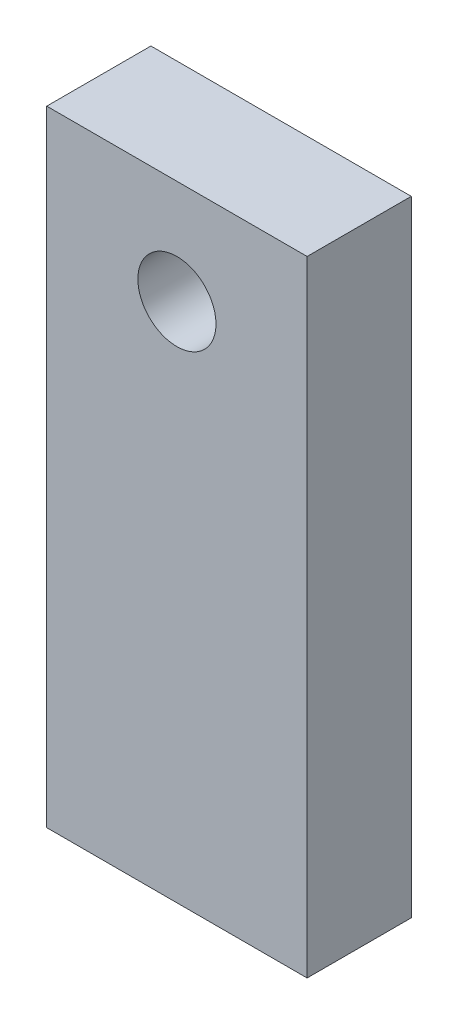
ISO-10303-21;
HEADER;
FILE_DESCRIPTION(('STEP AP214'),'2;1');
FILE_NAME('part.step','',(''),(''),'','','');
FILE_SCHEMA(('AUTOMOTIVE_DESIGN { 1 0 10303 214 1 1 1 1 }'));
ENDSEC;
DATA;
#1=APPLICATION_CONTEXT('core data for automotive mechanical design processes');
#2=APPLICATION_PROTOCOL_DEFINITION('international standard','automotive_design',2000,#1);
#3=PRODUCT_CONTEXT('',#1,'mechanical');
#4=PRODUCT('Part','Part','',(#3));
#5=PRODUCT_RELATED_PRODUCT_CATEGORY('part','',(#4));
#6=PRODUCT_DEFINITION_FORMATION('','',#4);
#7=PRODUCT_DEFINITION_CONTEXT('part definition',#1,'design');
#8=PRODUCT_DEFINITION('design','',#6,#7);
#9=PRODUCT_DEFINITION_SHAPE('','',#8);
#10=(LENGTH_UNIT() NAMED_UNIT(*) SI_UNIT(.MILLI.,.METRE.));
#11=(NAMED_UNIT(*) PLANE_ANGLE_UNIT() SI_UNIT($,.RADIAN.));
#12=(NAMED_UNIT(*) SI_UNIT($,.STERADIAN.) SOLID_ANGLE_UNIT());
#13=UNCERTAINTY_MEASURE_WITH_UNIT(LENGTH_MEASURE(1.E-05),#10,'distance_accuracy_value','');
#14=(GEOMETRIC_REPRESENTATION_CONTEXT(3) GLOBAL_UNCERTAINTY_ASSIGNED_CONTEXT((#13)) GLOBAL_UNIT_ASSIGNED_CONTEXT((#10,
#11,#12)) REPRESENTATION_CONTEXT('',''));
#15=CARTESIAN_POINT('',(0.,0.,0.));
#16=DIRECTION('',(0.,0.,1.));
#17=DIRECTION('',(1.,0.,0.));
#18=AXIS2_PLACEMENT_3D('',#15,#16,#17);
#19=CARTESIAN_POINT('',(0.,0.,4.));
#20=DIRECTION('',(0.,0.,1.));
#21=DIRECTION('',(1.,0.,0.));
#22=AXIS2_PLACEMENT_3D('',#19,#20,#21);
#23=PLANE('',#22);
#24=DIRECTION('',(1.,0.,0.));
#25=VECTOR('',#24,1.);
#26=CARTESIAN_POINT('',(-10.,570.,4.));
#27=LINE('',#26,#25);
#28=CARTESIAN_POINT('',(-10.,570.,4.));
#29=VERTEX_POINT('',#28);
#30=CARTESIAN_POINT('',(10.,570.,4.));
#31=VERTEX_POINT('',#30);
#32=EDGE_CURVE('E165',#29,#31,#27,.T.);
#33=ORIENTED_EDGE('',*,*,#32,.T.);
#34=DIRECTION('',(0.,1.,0.));
#35=VECTOR('',#34,1.);
#36=CARTESIAN_POINT('',(10.,570.,4.));
#37=LINE('',#36,#35);
#38=CARTESIAN_POINT('',(10.,618.,4.));
#39=VERTEX_POINT('',#38);
#40=EDGE_CURVE('E135',#31,#39,#37,.T.);
#41=ORIENTED_EDGE('',*,*,#40,.T.);
#42=DIRECTION('',(1.,0.,0.));
#43=VECTOR('',#42,1.);
#44=CARTESIAN_POINT('',(-10.,618.,4.));
#45=LINE('',#44,#43);
#46=CARTESIAN_POINT('',(-10.,618.,4.));
#47=VERTEX_POINT('',#46);
#48=EDGE_CURVE('E170',#47,#39,#45,.T.);
#49=ORIENTED_EDGE('',*,*,#48,.F.);
#50=DIRECTION('',(0.,1.,0.));
#51=VECTOR('',#50,1.);
#52=CARTESIAN_POINT('',(-10.,610.,4.));
#53=LINE('',#52,#51);
#54=EDGE_CURVE('E103',#29,#47,#53,.T.);
#55=ORIENTED_EDGE('',*,*,#54,.F.);
#56=EDGE_LOOP('',(#33,#41,#49,#55));
#57=FACE_BOUND('',#56,.T.);
#58=CARTESIAN_POINT('',(0.,610.,4.));
#59=DIRECTION('',(0.,0.,1.));
#60=DIRECTION('',(1.,0.,0.));
#61=AXIS2_PLACEMENT_3D('',#58,#59,#60);
#62=CIRCLE('',#61,2.99999999999998);
#63=CARTESIAN_POINT('',(2.99999999999998,610.,4.));
#64=VERTEX_POINT('',#63);
#65=EDGE_CURVE('E161',#64,#64,#62,.T.);
#66=ORIENTED_EDGE('',*,*,#65,.F.);
#67=EDGE_LOOP('',(#66));
#68=FACE_BOUND('',#67,.T.);
#69=ADVANCED_FACE('F87',(#57,#68),#23,.T.);
#70=CARTESIAN_POINT('',(-10.,570.,4.));
#71=DIRECTION('',(0.,1.,0.));
#72=DIRECTION('',(0.,0.,1.));
#73=AXIS2_PLACEMENT_3D('',#70,#71,#72);
#74=PLANE('',#73);
#75=DIRECTION('',(0.,0.,-1.));
#76=VECTOR('',#75,1.);
#77=CARTESIAN_POINT('',(-10.,570.,4.));
#78=LINE('',#77,#76);
#79=CARTESIAN_POINT('',(-10.,570.,-4.));
#80=VERTEX_POINT('',#79);
#81=EDGE_CURVE('E147',#29,#80,#78,.T.);
#82=ORIENTED_EDGE('',*,*,#81,.T.);
#83=DIRECTION('',(1.,0.,0.));
#84=VECTOR('',#83,1.);
#85=CARTESIAN_POINT('',(-10.,570.,-4.));
#86=LINE('',#85,#84);
#87=CARTESIAN_POINT('',(10.,570.,-4.));
#88=VERTEX_POINT('',#87);
#89=EDGE_CURVE('E143',#80,#88,#86,.T.);
#90=ORIENTED_EDGE('',*,*,#89,.T.);
#91=DIRECTION('',(0.,0.,-1.));
#92=VECTOR('',#91,1.);
#93=CARTESIAN_POINT('',(10.,570.,4.));
#94=LINE('',#93,#92);
#95=EDGE_CURVE('E12',#31,#88,#94,.T.);
#96=ORIENTED_EDGE('',*,*,#95,.F.);
#97=ORIENTED_EDGE('',*,*,#32,.F.);
#98=EDGE_LOOP('',(#82,#90,#96,#97));
#99=FACE_BOUND('',#98,.T.);
#100=ADVANCED_FACE('F89',(#99),#74,.F.);
#101=CARTESIAN_POINT('',(10.,618.,4.));
#102=DIRECTION('',(1.,0.,0.));
#103=DIRECTION('',(0.,1.,0.));
#104=AXIS2_PLACEMENT_3D('',#101,#102,#103);
#105=PLANE('',#104);
#106=ORIENTED_EDGE('',*,*,#95,.T.);
#107=DIRECTION('',(0.,1.,0.));
#108=VECTOR('',#107,1.);
#109=CARTESIAN_POINT('',(10.,570.,-4.));
#110=LINE('',#109,#108);
#111=CARTESIAN_POINT('',(10.,618.,-4.));
#112=VERTEX_POINT('',#111);
#113=EDGE_CURVE('E133',#88,#112,#110,.T.);
#114=ORIENTED_EDGE('',*,*,#113,.T.);
#115=DIRECTION('',(0.,0.,-1.));
#116=VECTOR('',#115,1.);
#117=CARTESIAN_POINT('',(10.,618.,4.));
#118=LINE('',#117,#116);
#119=EDGE_CURVE('E96',#39,#112,#118,.T.);
#120=ORIENTED_EDGE('',*,*,#119,.F.);
#121=ORIENTED_EDGE('',*,*,#40,.F.);
#122=EDGE_LOOP('',(#106,#114,#120,#121));
#123=FACE_BOUND('',#122,.T.);
#124=ADVANCED_FACE('F131',(#123),#105,.T.);
#125=CARTESIAN_POINT('',(-10.,618.,4.));
#126=DIRECTION('',(0.,1.,0.));
#127=DIRECTION('',(0.,0.,1.));
#128=AXIS2_PLACEMENT_3D('',#125,#126,#127);
#129=PLANE('',#128);
#130=ORIENTED_EDGE('',*,*,#119,.T.);
#131=DIRECTION('',(1.,0.,0.));
#132=VECTOR('',#131,1.);
#133=CARTESIAN_POINT('',(-10.,618.,-4.));
#134=LINE('',#133,#132);
#135=CARTESIAN_POINT('',(-10.,618.,-4.));
#136=VERTEX_POINT('',#135);
#137=EDGE_CURVE('E144',#136,#112,#134,.T.);
#138=ORIENTED_EDGE('',*,*,#137,.F.);
#139=DIRECTION('',(0.,0.,-1.));
#140=VECTOR('',#139,1.);
#141=CARTESIAN_POINT('',(-10.,618.,4.));
#142=LINE('',#141,#140);
#143=EDGE_CURVE('E111',#47,#136,#142,.T.);
#144=ORIENTED_EDGE('',*,*,#143,.F.);
#145=ORIENTED_EDGE('',*,*,#48,.T.);
#146=EDGE_LOOP('',(#130,#138,#144,#145));
#147=FACE_BOUND('',#146,.T.);
#148=ADVANCED_FACE('F179',(#147),#129,.T.);
#149=CARTESIAN_POINT('',(-10.,610.,4.));
#150=DIRECTION('',(1.,0.,0.));
#151=DIRECTION('',(0.,0.,-1.));
#152=AXIS2_PLACEMENT_3D('',#149,#150,#151);
#153=PLANE('',#152);
#154=ORIENTED_EDGE('',*,*,#143,.T.);
#155=DIRECTION('',(0.,1.,0.));
#156=VECTOR('',#155,1.);
#157=CARTESIAN_POINT('',(-10.,610.,-4.));
#158=LINE('',#157,#156);
#159=EDGE_CURVE('E158',#80,#136,#158,.T.);
#160=ORIENTED_EDGE('',*,*,#159,.F.);
#161=ORIENTED_EDGE('',*,*,#81,.F.);
#162=ORIENTED_EDGE('',*,*,#54,.T.);
#163=EDGE_LOOP('',(#154,#160,#161,#162));
#164=FACE_BOUND('',#163,.T.);
#165=ADVANCED_FACE('F182',(#164),#153,.F.);
#166=CARTESIAN_POINT('',(0.,610.,4.));
#167=DIRECTION('',(0.,0.,-1.));
#168=DIRECTION('',(-1.,0.,0.));
#169=AXIS2_PLACEMENT_3D('',#166,#167,#168);
#170=CYLINDRICAL_SURFACE('',#169,2.99999999999998);
#171=ORIENTED_EDGE('',*,*,#65,.T.);
#172=EDGE_LOOP('',(#171));
#173=FACE_BOUND('',#172,.T.);
#174=CARTESIAN_POINT('',(0.,610.,-4.));
#175=DIRECTION('',(0.,0.,1.));
#176=DIRECTION('',(1.,0.,0.));
#177=AXIS2_PLACEMENT_3D('',#174,#175,#176);
#178=CIRCLE('',#177,2.99999999999998);
#179=CARTESIAN_POINT('',(2.99999999999998,610.,-4.));
#180=VERTEX_POINT('',#179);
#181=EDGE_CURVE('E150',#180,#180,#178,.T.);
#182=ORIENTED_EDGE('',*,*,#181,.F.);
#183=EDGE_LOOP('',(#182));
#184=FACE_BOUND('',#183,.T.);
#185=ADVANCED_FACE('F184',(#173,#184),#170,.F.);
#186=CARTESIAN_POINT('',(0.,0.,-4.));
#187=DIRECTION('',(0.,0.,1.));
#188=DIRECTION('',(1.,0.,0.));
#189=AXIS2_PLACEMENT_3D('',#186,#187,#188);
#190=PLANE('',#189);
#191=ORIENTED_EDGE('',*,*,#181,.T.);
#192=EDGE_LOOP('',(#191));
#193=FACE_BOUND('',#192,.T.);
#194=ORIENTED_EDGE('',*,*,#89,.F.);
#195=ORIENTED_EDGE('',*,*,#159,.T.);
#196=ORIENTED_EDGE('',*,*,#137,.T.);
#197=ORIENTED_EDGE('',*,*,#113,.F.);
#198=EDGE_LOOP('',(#194,#195,#196,#197));
#199=FACE_BOUND('',#198,.T.);
#200=ADVANCED_FACE('F141',(#193,#199),#190,.F.);
#201=CLOSED_SHELL('',(#69,#100,#124,#148,#165,#185,#200));
#202=MANIFOLD_SOLID_BREP('B2',#201);
#203=ADVANCED_BREP_SHAPE_REPRESENTATION('',(#18,#202),#14);
#204=SHAPE_DEFINITION_REPRESENTATION(#9,#203);
ENDSEC;
END-ISO-10303-21;
